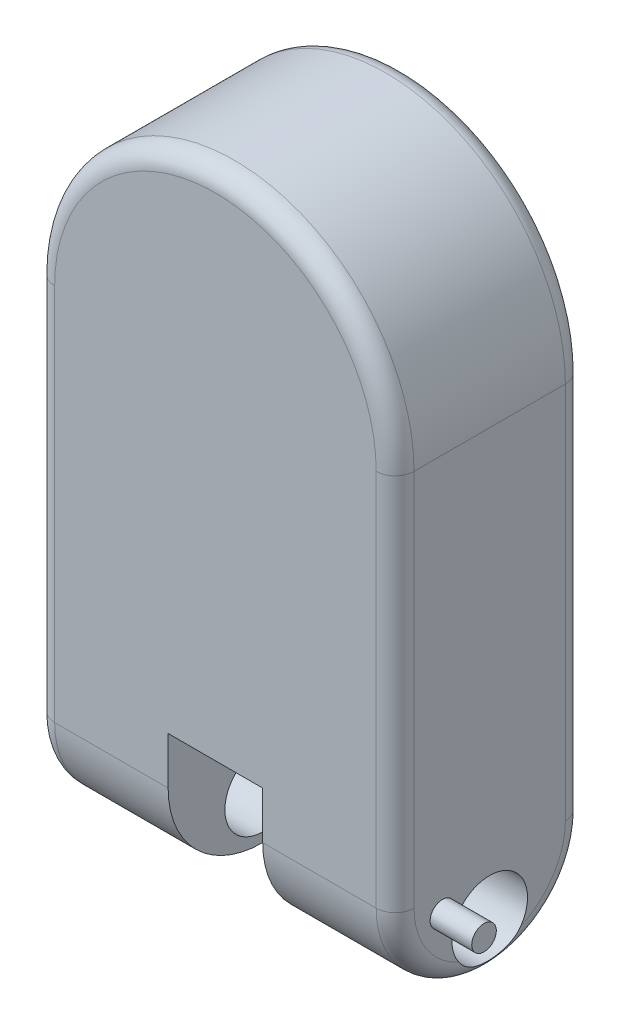
ISO-10303-21;
HEADER;
FILE_DESCRIPTION(('STEP AP214'),'2;1');
FILE_NAME('part.step','',(''),(''),'','','');
FILE_SCHEMA(('AUTOMOTIVE_DESIGN { 1 0 10303 214 1 1 1 1 }'));
ENDSEC;
DATA;
#1=APPLICATION_CONTEXT('core data for automotive mechanical design processes');
#2=APPLICATION_PROTOCOL_DEFINITION('international standard','automotive_design',2000,#1);
#3=PRODUCT_CONTEXT('',#1,'mechanical');
#4=PRODUCT('Part','Part','',(#3));
#5=PRODUCT_RELATED_PRODUCT_CATEGORY('part','',(#4));
#6=PRODUCT_DEFINITION_FORMATION('','',#4);
#7=PRODUCT_DEFINITION_CONTEXT('part definition',#1,'design');
#8=PRODUCT_DEFINITION('design','',#6,#7);
#9=PRODUCT_DEFINITION_SHAPE('','',#8);
#10=(LENGTH_UNIT() NAMED_UNIT(*) SI_UNIT(.MILLI.,.METRE.));
#11=(NAMED_UNIT(*) PLANE_ANGLE_UNIT() SI_UNIT($,.RADIAN.));
#12=(NAMED_UNIT(*) SI_UNIT($,.STERADIAN.) SOLID_ANGLE_UNIT());
#13=UNCERTAINTY_MEASURE_WITH_UNIT(LENGTH_MEASURE(1.E-05),#10,'distance_accuracy_value','');
#14=(GEOMETRIC_REPRESENTATION_CONTEXT(3) GLOBAL_UNCERTAINTY_ASSIGNED_CONTEXT((#13)) GLOBAL_UNIT_ASSIGNED_CONTEXT((#10,
#11,#12)) REPRESENTATION_CONTEXT('',''));
#15=CARTESIAN_POINT('',(0.,0.,0.));
#16=DIRECTION('',(0.,0.,1.));
#17=DIRECTION('',(1.,0.,0.));
#18=AXIS2_PLACEMENT_3D('',#15,#16,#17);
#19=CARTESIAN_POINT('',(-25.,-75.,-100.1));
#20=DIRECTION('',(0.,-1.,0.));
#21=DIRECTION('',(0.,0.,-1.));
#22=AXIS2_PLACEMENT_3D('',#19,#20,#21);
#23=PLANE('',#22);
#24=DIRECTION('',(1.,0.,0.));
#25=VECTOR('',#24,1.);
#26=CARTESIAN_POINT('',(-25.,-75.,-100.));
#27=LINE('',#26,#25);
#28=CARTESIAN_POINT('',(-25.,-75.,-100.));
#29=VERTEX_POINT('',#28);
#30=CARTESIAN_POINT('',(25.,-75.,-100.));
#31=VERTEX_POINT('',#30);
#32=EDGE_CURVE('E97',#29,#31,#27,.T.);
#33=ORIENTED_EDGE('',*,*,#32,.T.);
#34=CARTESIAN_POINT('',(23.5893264020334,-75.,-90.1));
#35=DIRECTION('',(0.,-1.,0.));
#36=DIRECTION('',(0.,0.,-1.));
#37=AXIS2_PLACEMENT_3D('',#34,#35,#36);
#38=CIRCLE('',#37,10.);
#39=CARTESIAN_POINT('',(23.5893264020334,-75.,-100.1));
#40=VERTEX_POINT('',#39);
#41=EDGE_CURVE('E12',#31,#40,#38,.F.);
#42=ORIENTED_EDGE('',*,*,#41,.T.);
#43=DIRECTION('',(1.,0.,0.));
#44=VECTOR('',#43,1.);
#45=CARTESIAN_POINT('',(-25.,-75.,-100.1));
#46=LINE('',#45,#44);
#47=CARTESIAN_POINT('',(-23.5893264020334,-75.,-100.1));
#48=VERTEX_POINT('',#47);
#49=EDGE_CURVE('E121',#48,#40,#46,.T.);
#50=ORIENTED_EDGE('',*,*,#49,.F.);
#51=CARTESIAN_POINT('',(-23.5893264020334,-75.,-90.1));
#52=DIRECTION('',(0.,-1.,0.));
#53=DIRECTION('',(0.,0.,-1.));
#54=AXIS2_PLACEMENT_3D('',#51,#52,#53);
#55=CIRCLE('',#54,10.);
#56=EDGE_CURVE('E60',#48,#29,#55,.F.);
#57=ORIENTED_EDGE('',*,*,#56,.T.);
#58=EDGE_LOOP('',(#33,#42,#50,#57));
#59=FACE_BOUND('',#58,.T.);
#60=ADVANCED_FACE('F51',(#59),#23,.F.);
#61=CARTESIAN_POINT('',(0.,0.,-100.1));
#62=DIRECTION('',(0.,0.,-1.));
#63=DIRECTION('',(-1.,0.,0.));
#64=AXIS2_PLACEMENT_3D('',#61,#62,#63);
#65=PLANE('',#64);
#66=ORIENTED_EDGE('',*,*,#49,.T.);
#67=DIRECTION('',(0.,1.,0.));
#68=VECTOR('',#67,1.);
#69=CARTESIAN_POINT('',(23.5893264020334,-105.,-100.1));
#70=LINE('',#69,#68);
#71=CARTESIAN_POINT('',(23.5893264020334,-103.589326402033,-100.1));
#72=VERTEX_POINT('',#71);
#73=EDGE_CURVE('E109',#40,#72,#70,.F.);
#74=ORIENTED_EDGE('',*,*,#73,.T.);
#75=DIRECTION('',(1.,0.,0.));
#76=VECTOR('',#75,1.);
#77=CARTESIAN_POINT('',(-25.,-103.589326402033,-100.1));
#78=LINE('',#77,#76);
#79=CARTESIAN_POINT('',(-23.5893264020334,-103.589326402033,-100.1));
#80=VERTEX_POINT('',#79);
#81=EDGE_CURVE('E75',#72,#80,#78,.F.);
#82=ORIENTED_EDGE('',*,*,#81,.T.);
#83=DIRECTION('',(0.,-1.,0.));
#84=VECTOR('',#83,1.);
#85=CARTESIAN_POINT('',(-23.5893264020334,-75.,-100.1));
#86=LINE('',#85,#84);
#87=EDGE_CURVE('E112',#80,#48,#86,.F.);
#88=ORIENTED_EDGE('',*,*,#87,.T.);
#89=EDGE_LOOP('',(#66,#74,#82,#88));
#90=FACE_BOUND('',#89,.T.);
#91=ADVANCED_FACE('F125',(#90),#65,.T.);
#92=CARTESIAN_POINT('',(0.,0.,-100.));
#93=DIRECTION('',(0.,0.,-1.));
#94=DIRECTION('',(-1.,0.,0.));
#95=AXIS2_PLACEMENT_3D('',#92,#93,#94);
#96=PLANE('',#95);
#97=ORIENTED_EDGE('',*,*,#32,.F.);
#98=DIRECTION('',(0.,1.,0.));
#99=VECTOR('',#98,1.);
#100=CARTESIAN_POINT('',(-25.,-105.,-100.));
#101=LINE('',#100,#99);
#102=CARTESIAN_POINT('',(-25.,-105.,-100.));
#103=VERTEX_POINT('',#102);
#104=EDGE_CURVE('E120',#103,#29,#101,.T.);
#105=ORIENTED_EDGE('',*,*,#104,.F.);
#106=DIRECTION('',(-1.,0.,0.));
#107=VECTOR('',#106,1.);
#108=CARTESIAN_POINT('',(25.,-105.,-100.));
#109=LINE('',#108,#107);
#110=CARTESIAN_POINT('',(25.,-105.,-100.));
#111=VERTEX_POINT('',#110);
#112=EDGE_CURVE('E100',#111,#103,#109,.T.);
#113=ORIENTED_EDGE('',*,*,#112,.F.);
#114=DIRECTION('',(0.,-1.,0.));
#115=VECTOR('',#114,1.);
#116=CARTESIAN_POINT('',(25.,-75.,-100.));
#117=LINE('',#116,#115);
#118=EDGE_CURVE('E94',#31,#111,#117,.T.);
#119=ORIENTED_EDGE('',*,*,#118,.F.);
#120=EDGE_LOOP('',(#97,#105,#113,#119));
#121=FACE_BOUND('',#120,.T.);
#122=ADVANCED_FACE('F96',(#121),#96,.F.);
#123=CARTESIAN_POINT('',(-23.5893264020334,-105.,-90.1));
#124=DIRECTION('',(0.,1.,0.));
#125=DIRECTION('',(0.,0.,1.));
#126=AXIS2_PLACEMENT_3D('',#123,#124,#125);
#127=CYLINDRICAL_SURFACE('',#126,10.);
#128=ORIENTED_EDGE('',*,*,#56,.F.);
#129=ORIENTED_EDGE('',*,*,#87,.F.);
#130=CARTESIAN_POINT('',(-23.5893264020334,-103.589326402033,-90.1));
#131=DIRECTION('',(-0.707106781186547,0.707106781186547,0.));
#132=DIRECTION('',(0.707106781186547,0.707106781186547,0.));
#133=AXIS2_PLACEMENT_3D('',#130,#131,#132);
#134=ELLIPSE('',#133,14.1421356237309,10.);
#135=EDGE_CURVE('E55',#103,#80,#134,.F.);
#136=ORIENTED_EDGE('',*,*,#135,.F.);
#137=ORIENTED_EDGE('',*,*,#104,.T.);
#138=EDGE_LOOP('',(#128,#129,#136,#137));
#139=FACE_BOUND('',#138,.T.);
#140=ADVANCED_FACE('F53',(#139),#127,.T.);
#141=CARTESIAN_POINT('',(25.,-103.589326402033,-90.1));
#142=DIRECTION('',(-1.,0.,0.));
#143=DIRECTION('',(0.,0.,1.));
#144=AXIS2_PLACEMENT_3D('',#141,#142,#143);
#145=CYLINDRICAL_SURFACE('',#144,10.);
#146=ORIENTED_EDGE('',*,*,#135,.T.);
#147=ORIENTED_EDGE('',*,*,#81,.F.);
#148=CARTESIAN_POINT('',(23.5893264020334,-103.589326402033,-90.1));
#149=DIRECTION('',(-0.707106781186547,-0.707106781186548,0.));
#150=DIRECTION('',(-0.707106781186548,0.707106781186547,0.));
#151=AXIS2_PLACEMENT_3D('',#148,#149,#150);
#152=ELLIPSE('',#151,14.142135623731,10.);
#153=EDGE_CURVE('E68',#111,#72,#152,.F.);
#154=ORIENTED_EDGE('',*,*,#153,.F.);
#155=ORIENTED_EDGE('',*,*,#112,.T.);
#156=EDGE_LOOP('',(#146,#147,#154,#155));
#157=FACE_BOUND('',#156,.T.);
#158=ADVANCED_FACE('F118',(#157),#145,.T.);
#159=CARTESIAN_POINT('',(23.5893264020334,-75.,-90.1));
#160=DIRECTION('',(0.,-1.,0.));
#161=DIRECTION('',(1.,0.,0.));
#162=AXIS2_PLACEMENT_3D('',#159,#160,#161);
#163=CYLINDRICAL_SURFACE('',#162,10.);
#164=ORIENTED_EDGE('',*,*,#41,.F.);
#165=ORIENTED_EDGE('',*,*,#118,.T.);
#166=ORIENTED_EDGE('',*,*,#153,.T.);
#167=ORIENTED_EDGE('',*,*,#73,.F.);
#168=EDGE_LOOP('',(#164,#165,#166,#167));
#169=FACE_BOUND('',#168,.T.);
#170=ADVANCED_FACE('F108',(#169),#163,.T.);
#171=CLOSED_SHELL('',(#60,#91,#122,#140,#158,#170));
#172=MANIFOLD_SOLID_BREP('B2',#171);
#173=CARTESIAN_POINT('',(0.,-75.,-50.));
#174=DIRECTION('',(1.,0.,0.));
#175=DIRECTION('',(0.,0.,-1.));
#176=AXIS2_PLACEMENT_3D('',#173,#174,#175);
#177=CYLINDRICAL_SURFACE('',#176,50.);
#178=DIRECTION('',(1.,0.,0.));
#179=VECTOR('',#178,1.);
#180=CARTESIAN_POINT('',(0.,-75.,0.));
#181=LINE('',#180,#179);
#182=CARTESIAN_POINT('',(-85.,-75.,0.));
#183=VERTEX_POINT('',#182);
#184=CARTESIAN_POINT('',(-25.,-75.,0.));
#185=VERTEX_POINT('',#184);
#186=EDGE_CURVE('E398',#183,#185,#181,.T.);
#187=ORIENTED_EDGE('',*,*,#186,.F.);
#188=CARTESIAN_POINT('',(-85.,-75.,-50.));
#189=DIRECTION('',(-1.,0.,0.));
#190=DIRECTION('',(0.,-1.,0.));
#191=AXIS2_PLACEMENT_3D('',#188,#189,#190);
#192=CIRCLE('',#191,50.);
#193=CARTESIAN_POINT('',(-85.,-125.,-50.));
#194=VERTEX_POINT('',#193);
#195=EDGE_CURVE('E198',#183,#194,#192,.F.);
#196=ORIENTED_EDGE('',*,*,#195,.T.);
#197=DIRECTION('',(1.,0.,0.));
#198=VECTOR('',#197,1.);
#199=CARTESIAN_POINT('',(-95.,-125.,-50.));
#200=LINE('',#199,#198);
#201=CARTESIAN_POINT('',(-25.,-125.,-50.));
#202=VERTEX_POINT('',#201);
#203=EDGE_CURVE('E354',#202,#194,#200,.F.);
#204=ORIENTED_EDGE('',*,*,#203,.F.);
#205=CARTESIAN_POINT('',(-25.,-75.,-50.));
#206=DIRECTION('',(-1.,0.,0.));
#207=DIRECTION('',(0.,0.,1.));
#208=AXIS2_PLACEMENT_3D('',#205,#206,#207);
#209=CIRCLE('',#208,50.);
#210=EDGE_CURVE('E373',#185,#202,#209,.F.);
#211=ORIENTED_EDGE('',*,*,#210,.F.);
#212=EDGE_LOOP('',(#187,#196,#204,#211));
#213=FACE_BOUND('',#212,.T.);
#214=ADVANCED_FACE('F175',(#213),#177,.T.);
#215=CARTESIAN_POINT('',(-95.,-75.,-50.));
#216=DIRECTION('',(-1.,0.,0.));
#217=DIRECTION('',(0.,0.,1.));
#218=AXIS2_PLACEMENT_3D('',#215,#216,#217);
#219=CYLINDRICAL_SURFACE('',#218,50.);
#220=ORIENTED_EDGE('',*,*,#203,.T.);
#221=CARTESIAN_POINT('',(-85.,-75.,-50.));
#222=DIRECTION('',(-1.,0.,0.));
#223=DIRECTION('',(0.,-1.,0.));
#224=AXIS2_PLACEMENT_3D('',#221,#222,#223);
#225=CIRCLE('',#224,50.);
#226=CARTESIAN_POINT('',(-85.,-75.,-100.));
#227=VERTEX_POINT('',#226);
#228=EDGE_CURVE('E184',#194,#227,#225,.F.);
#229=ORIENTED_EDGE('',*,*,#228,.T.);
#230=DIRECTION('',(1.,0.,0.));
#231=VECTOR('',#230,1.);
#232=CARTESIAN_POINT('',(-95.,-75.,-100.));
#233=LINE('',#232,#231);
#234=CARTESIAN_POINT('',(-25.,-75.,-100.));
#235=VERTEX_POINT('',#234);
#236=EDGE_CURVE('E393',#235,#227,#233,.F.);
#237=ORIENTED_EDGE('',*,*,#236,.F.);
#238=CARTESIAN_POINT('',(-25.,-75.,-50.));
#239=DIRECTION('',(-1.,0.,0.));
#240=DIRECTION('',(0.,0.,1.));
#241=AXIS2_PLACEMENT_3D('',#238,#239,#240);
#242=CIRCLE('',#241,50.);
#243=EDGE_CURVE('E382',#202,#235,#242,.F.);
#244=ORIENTED_EDGE('',*,*,#243,.F.);
#245=EDGE_LOOP('',(#220,#229,#237,#244));
#246=FACE_BOUND('',#245,.T.);
#247=ADVANCED_FACE('F511',(#246),#219,.T.);
#248=CARTESIAN_POINT('',(95.,125.,-100.));
#249=DIRECTION('',(1.,0.,0.));
#250=DIRECTION('',(0.,1.,0.));
#251=AXIS2_PLACEMENT_3D('',#248,#249,#250);
#252=PLANE('',#251);
#253=CARTESIAN_POINT('',(95.,-85.,-25.));
#254=DIRECTION('',(1.,0.,0.));
#255=DIRECTION('',(0.,1.,0.));
#256=AXIS2_PLACEMENT_3D('',#253,#254,#255);
#257=CIRCLE('',#256,6.50000000000002);
#258=CARTESIAN_POINT('',(95.,-78.5,-25.));
#259=VERTEX_POINT('',#258);
#260=EDGE_CURVE('E694',#259,#259,#257,.T.);
#261=ORIENTED_EDGE('',*,*,#260,.F.);
#262=EDGE_LOOP('',(#261));
#263=FACE_BOUND('',#262,.T.);
#264=CARTESIAN_POINT('',(95.,-75.,-50.));
#265=DIRECTION('',(1.,0.,0.));
#266=DIRECTION('',(0.,1.,0.));
#267=AXIS2_PLACEMENT_3D('',#264,#265,#266);
#268=CIRCLE('',#267,40.);
#269=CARTESIAN_POINT('',(95.0000000000001,-111.5,-66.3630681719536));
#270=VERTEX_POINT('',#269);
#271=CARTESIAN_POINT('',(95.,-75.,-90.));
#272=VERTEX_POINT('',#271);
#273=EDGE_CURVE('E430',#270,#272,#268,.T.);
#274=ORIENTED_EDGE('',*,*,#273,.T.);
#275=DIRECTION('',(0.,1.,0.));
#276=VECTOR('',#275,1.);
#277=CARTESIAN_POINT('',(95.,125.,-90.));
#278=LINE('',#277,#276);
#279=CARTESIAN_POINT('',(95.,125.,-90.));
#280=VERTEX_POINT('',#279);
#281=EDGE_CURVE('E433',#272,#280,#278,.T.);
#282=ORIENTED_EDGE('',*,*,#281,.T.);
#283=DIRECTION('',(0.,0.,1.));
#284=VECTOR('',#283,1.);
#285=CARTESIAN_POINT('',(95.,125.,-100.));
#286=LINE('',#285,#284);
#287=CARTESIAN_POINT('',(95.,125.,-9.99999999999999));
#288=VERTEX_POINT('',#287);
#289=EDGE_CURVE('E368',#280,#288,#286,.T.);
#290=ORIENTED_EDGE('',*,*,#289,.T.);
#291=DIRECTION('',(0.,1.,0.));
#292=VECTOR('',#291,1.);
#293=CARTESIAN_POINT('',(95.,125.,-9.99999999999999));
#294=LINE('',#293,#292);
#295=CARTESIAN_POINT('',(95.,-75.,-10.));
#296=VERTEX_POINT('',#295);
#297=EDGE_CURVE('E424',#288,#296,#294,.F.);
#298=ORIENTED_EDGE('',*,*,#297,.T.);
#299=CARTESIAN_POINT('',(95.,-75.,-50.));
#300=DIRECTION('',(1.,0.,0.));
#301=DIRECTION('',(0.,1.,0.));
#302=AXIS2_PLACEMENT_3D('',#299,#300,#301);
#303=CIRCLE('',#302,40.);
#304=CARTESIAN_POINT('',(95.,-111.5,-33.6369318280464));
#305=VERTEX_POINT('',#304);
#306=EDGE_CURVE('E427',#296,#305,#303,.T.);
#307=ORIENTED_EDGE('',*,*,#306,.T.);
#308=CARTESIAN_POINT('',(95.,-100.,-50.));
#309=DIRECTION('',(-1.,0.,0.));
#310=DIRECTION('',(0.,-1.,0.));
#311=AXIS2_PLACEMENT_3D('',#308,#309,#310);
#312=CIRCLE('',#311,20.);
#313=EDGE_CURVE('E355',#305,#270,#312,.T.);
#314=ORIENTED_EDGE('',*,*,#313,.T.);
#315=EDGE_LOOP('',(#274,#282,#290,#298,#307,#314));
#316=FACE_BOUND('',#315,.T.);
#317=ADVANCED_FACE('F516',(#263,#316),#252,.T.);
#318=CARTESIAN_POINT('',(-95.,125.,-100.));
#319=DIRECTION('',(-1.,0.,0.));
#320=DIRECTION('',(0.,-1.,0.));
#321=AXIS2_PLACEMENT_3D('',#318,#319,#320);
#322=PLANE('',#321);
#323=CARTESIAN_POINT('',(-95.,-75.,-50.));
#324=DIRECTION('',(-1.,0.,0.));
#325=DIRECTION('',(0.,-1.,0.));
#326=AXIS2_PLACEMENT_3D('',#323,#324,#325);
#327=CIRCLE('',#326,40.);
#328=CARTESIAN_POINT('',(-95.,-111.5,-33.6369318280464));
#329=VERTEX_POINT('',#328);
#330=CARTESIAN_POINT('',(-95.,-75.,-10.));
#331=VERTEX_POINT('',#330);
#332=EDGE_CURVE('E596',#329,#331,#327,.T.);
#333=ORIENTED_EDGE('',*,*,#332,.T.);
#334=DIRECTION('',(0.,-1.,0.));
#335=VECTOR('',#334,1.);
#336=CARTESIAN_POINT('',(-95.,125.,-9.99999999999999));
#337=LINE('',#336,#335);
#338=CARTESIAN_POINT('',(-95.,125.,-9.99999999999999));
#339=VERTEX_POINT('',#338);
#340=EDGE_CURVE('E482',#331,#339,#337,.F.);
#341=ORIENTED_EDGE('',*,*,#340,.T.);
#342=DIRECTION('',(0.,0.,1.));
#343=VECTOR('',#342,1.);
#344=CARTESIAN_POINT('',(-95.,125.,-100.));
#345=LINE('',#344,#343);
#346=CARTESIAN_POINT('',(-95.,125.,-90.));
#347=VERTEX_POINT('',#346);
#348=EDGE_CURVE('E369',#347,#339,#345,.T.);
#349=ORIENTED_EDGE('',*,*,#348,.F.);
#350=DIRECTION('',(0.,-1.,0.));
#351=VECTOR('',#350,1.);
#352=CARTESIAN_POINT('',(-95.,-75.,-90.));
#353=LINE('',#352,#351);
#354=CARTESIAN_POINT('',(-95.,-75.,-90.));
#355=VERTEX_POINT('',#354);
#356=EDGE_CURVE('E588',#347,#355,#353,.T.);
#357=ORIENTED_EDGE('',*,*,#356,.T.);
#358=CARTESIAN_POINT('',(-95.,-75.,-50.));
#359=DIRECTION('',(-1.,0.,0.));
#360=DIRECTION('',(0.,-1.,0.));
#361=AXIS2_PLACEMENT_3D('',#358,#359,#360);
#362=CIRCLE('',#361,40.);
#363=CARTESIAN_POINT('',(-95.,-111.5,-66.3630681719536));
#364=VERTEX_POINT('',#363);
#365=EDGE_CURVE('E594',#355,#364,#362,.T.);
#366=ORIENTED_EDGE('',*,*,#365,.T.);
#367=CARTESIAN_POINT('',(-95.,-100.,-50.));
#368=DIRECTION('',(-1.,0.,0.));
#369=DIRECTION('',(0.,-1.,0.));
#370=AXIS2_PLACEMENT_3D('',#367,#368,#369);
#371=CIRCLE('',#370,20.);
#372=EDGE_CURVE('E360',#329,#364,#371,.T.);
#373=ORIENTED_EDGE('',*,*,#372,.F.);
#374=EDGE_LOOP('',(#333,#341,#349,#357,#366,#373));
#375=FACE_BOUND('',#374,.T.);
#376=ADVANCED_FACE('F603',(#375),#322,.T.);
#377=CARTESIAN_POINT('',(0.,0.,-100.));
#378=DIRECTION('',(0.,0.,1.));
#379=DIRECTION('',(1.,0.,0.));
#380=AXIS2_PLACEMENT_3D('',#377,#378,#379);
#381=PLANE('',#380);
#382=CARTESIAN_POINT('',(0.,125.,-100.));
#383=DIRECTION('',(0.,0.,1.));
#384=DIRECTION('',(1.,0.,0.));
#385=AXIS2_PLACEMENT_3D('',#382,#383,#384);
#386=CIRCLE('',#385,85.);
#387=CARTESIAN_POINT('',(-85.,125.,-100.));
#388=VERTEX_POINT('',#387);
#389=CARTESIAN_POINT('',(85.,125.,-100.));
#390=VERTEX_POINT('',#389);
#391=EDGE_CURVE('E417',#388,#390,#386,.F.);
#392=ORIENTED_EDGE('',*,*,#391,.T.);
#393=DIRECTION('',(0.,1.,0.));
#394=VECTOR('',#393,1.);
#395=CARTESIAN_POINT('',(85.,-75.,-100.));
#396=LINE('',#395,#394);
#397=CARTESIAN_POINT('',(85.,-75.,-100.));
#398=VERTEX_POINT('',#397);
#399=EDGE_CURVE('E421',#390,#398,#396,.F.);
#400=ORIENTED_EDGE('',*,*,#399,.T.);
#401=CARTESIAN_POINT('',(25.,-75.,-100.));
#402=VERTEX_POINT('',#401);
#403=EDGE_CURVE('E399',#398,#402,#233,.F.);
#404=ORIENTED_EDGE('',*,*,#403,.T.);
#405=DIRECTION('',(-1.,0.,0.));
#406=VECTOR('',#405,1.);
#407=CARTESIAN_POINT('',(-25.,-75.,-100.));
#408=LINE('',#407,#406);
#409=EDGE_CURVE('E346',#402,#235,#408,.T.);
#410=ORIENTED_EDGE('',*,*,#409,.T.);
#411=ORIENTED_EDGE('',*,*,#236,.T.);
#412=DIRECTION('',(0.,-1.,0.));
#413=VECTOR('',#412,1.);
#414=CARTESIAN_POINT('',(-85.,125.,-100.));
#415=LINE('',#414,#413);
#416=EDGE_CURVE('E414',#227,#388,#415,.F.);
#417=ORIENTED_EDGE('',*,*,#416,.T.);
#418=EDGE_LOOP('',(#392,#400,#404,#410,#411,#417));
#419=FACE_BOUND('',#418,.T.);
#420=ADVANCED_FACE('F651',(#419),#381,.F.);
#421=CARTESIAN_POINT('',(0.,0.,0.));
#422=DIRECTION('',(0.,0.,1.));
#423=DIRECTION('',(1.,0.,0.));
#424=AXIS2_PLACEMENT_3D('',#421,#422,#423);
#425=PLANE('',#424);
#426=DIRECTION('',(0.,-1.,0.));
#427=VECTOR('',#426,1.);
#428=CARTESIAN_POINT('',(-25.,-75.,0.));
#429=LINE('',#428,#427);
#430=CARTESIAN_POINT('',(-25.,-50.,0.));
#431=VERTEX_POINT('',#430);
#432=EDGE_CURVE('E322',#431,#185,#429,.T.);
#433=ORIENTED_EDGE('',*,*,#432,.F.);
#434=DIRECTION('',(-1.,0.,0.));
#435=VECTOR('',#434,1.);
#436=CARTESIAN_POINT('',(-25.,-50.,0.));
#437=LINE('',#436,#435);
#438=CARTESIAN_POINT('',(25.,-50.,0.));
#439=VERTEX_POINT('',#438);
#440=EDGE_CURVE('E333',#439,#431,#437,.T.);
#441=ORIENTED_EDGE('',*,*,#440,.F.);
#442=DIRECTION('',(0.,1.,0.));
#443=VECTOR('',#442,1.);
#444=CARTESIAN_POINT('',(25.,-50.,0.));
#445=LINE('',#444,#443);
#446=CARTESIAN_POINT('',(25.,-75.,0.));
#447=VERTEX_POINT('',#446);
#448=EDGE_CURVE('E311',#447,#439,#445,.T.);
#449=ORIENTED_EDGE('',*,*,#448,.F.);
#450=CARTESIAN_POINT('',(85.,-75.,0.));
#451=VERTEX_POINT('',#450);
#452=EDGE_CURVE('E402',#447,#451,#181,.T.);
#453=ORIENTED_EDGE('',*,*,#452,.T.);
#454=DIRECTION('',(0.,1.,0.));
#455=VECTOR('',#454,1.);
#456=CARTESIAN_POINT('',(85.,0.,0.));
#457=LINE('',#456,#455);
#458=CARTESIAN_POINT('',(85.,125.,0.));
#459=VERTEX_POINT('',#458);
#460=EDGE_CURVE('E576',#451,#459,#457,.T.);
#461=ORIENTED_EDGE('',*,*,#460,.T.);
#462=CARTESIAN_POINT('',(0.,125.,0.));
#463=DIRECTION('',(0.,0.,1.));
#464=DIRECTION('',(1.,0.,0.));
#465=AXIS2_PLACEMENT_3D('',#462,#463,#464);
#466=CIRCLE('',#465,85.);
#467=CARTESIAN_POINT('',(-85.,125.,0.));
#468=VERTEX_POINT('',#467);
#469=EDGE_CURVE('E581',#459,#468,#466,.T.);
#470=ORIENTED_EDGE('',*,*,#469,.T.);
#471=DIRECTION('',(0.,-1.,0.));
#472=VECTOR('',#471,1.);
#473=CARTESIAN_POINT('',(-85.,0.,0.));
#474=LINE('',#473,#472);
#475=EDGE_CURVE('E544',#468,#183,#474,.T.);
#476=ORIENTED_EDGE('',*,*,#475,.T.);
#477=ORIENTED_EDGE('',*,*,#186,.T.);
#478=EDGE_LOOP('',(#433,#441,#449,#453,#461,#470,#476,#477));
#479=FACE_BOUND('',#478,.T.);
#480=ADVANCED_FACE('F663',(#479),#425,.T.);
#481=CARTESIAN_POINT('',(25.,-150.,-100.));
#482=DIRECTION('',(1.,0.,0.));
#483=DIRECTION('',(0.,0.,-1.));
#484=AXIS2_PLACEMENT_3D('',#481,#482,#483);
#485=PLANE('',#484);
#486=CARTESIAN_POINT('',(25.,-75.,-50.));
#487=DIRECTION('',(1.,0.,0.));
#488=DIRECTION('',(0.,0.,-1.));
#489=AXIS2_PLACEMENT_3D('',#486,#487,#488);
#490=CIRCLE('',#489,50.);
#491=CARTESIAN_POINT('',(25.,-125.,-50.));
#492=VERTEX_POINT('',#491);
#493=EDGE_CURVE('E386',#492,#447,#490,.F.);
#494=ORIENTED_EDGE('',*,*,#493,.T.);
#495=ORIENTED_EDGE('',*,*,#448,.T.);
#496=DIRECTION('',(0.,0.,1.));
#497=VECTOR('',#496,1.);
#498=CARTESIAN_POINT('',(25.,-50.,-99.));
#499=LINE('',#498,#497);
#500=CARTESIAN_POINT('',(25.,-50.,-99.));
#501=VERTEX_POINT('',#500);
#502=EDGE_CURVE('E303',#501,#439,#499,.T.);
#503=ORIENTED_EDGE('',*,*,#502,.F.);
#504=DIRECTION('',(0.,1.,0.));
#505=VECTOR('',#504,1.);
#506=CARTESIAN_POINT('',(25.,-50.,-99.));
#507=LINE('',#506,#505);
#508=CARTESIAN_POINT('',(25.,-74.4302970896538,-99.));
#509=VERTEX_POINT('',#508);
#510=EDGE_CURVE('E309',#509,#501,#507,.T.);
#511=ORIENTED_EDGE('',*,*,#510,.F.);
#512=CARTESIAN_POINT('',(25.,-161.602540378444,-50.));
#513=DIRECTION('',(1.,0.,0.));
#514=DIRECTION('',(0.,0.,-1.));
#515=AXIS2_PLACEMENT_3D('',#512,#513,#514);
#516=CIRCLE('',#515,100.);
#517=EDGE_CURVE('E347',#402,#509,#516,.T.);
#518=ORIENTED_EDGE('',*,*,#517,.F.);
#519=CARTESIAN_POINT('',(25.,-75.,-50.));
#520=DIRECTION('',(1.,0.,0.));
#521=DIRECTION('',(0.,0.,-1.));
#522=AXIS2_PLACEMENT_3D('',#519,#520,#521);
#523=CIRCLE('',#522,50.);
#524=EDGE_CURVE('E389',#402,#492,#523,.F.);
#525=ORIENTED_EDGE('',*,*,#524,.T.);
#526=EDGE_LOOP('',(#494,#495,#503,#511,#518,#525));
#527=FACE_BOUND('',#526,.T.);
#528=CARTESIAN_POINT('',(25.,-100.,-50.));
#529=DIRECTION('',(1.,0.,0.));
#530=DIRECTION('',(0.,0.,-1.));
#531=AXIS2_PLACEMENT_3D('',#528,#529,#530);
#532=CIRCLE('',#531,20.);
#533=CARTESIAN_POINT('',(25.,-100.,-70.));
#534=VERTEX_POINT('',#533);
#535=EDGE_CURVE('E364',#534,#534,#532,.T.);
#536=ORIENTED_EDGE('',*,*,#535,.T.);
#537=EDGE_LOOP('',(#536));
#538=FACE_BOUND('',#537,.T.);
#539=ADVANCED_FACE('F306',(#527,#538),#485,.F.);
#540=CARTESIAN_POINT('',(-25.,-150.,-100.));
#541=DIRECTION('',(-1.,0.,0.));
#542=DIRECTION('',(0.,0.,1.));
#543=AXIS2_PLACEMENT_3D('',#540,#541,#542);
#544=PLANE('',#543);
#545=ORIENTED_EDGE('',*,*,#432,.T.);
#546=ORIENTED_EDGE('',*,*,#210,.T.);
#547=ORIENTED_EDGE('',*,*,#243,.T.);
#548=CARTESIAN_POINT('',(-25.,-161.602540378444,-50.));
#549=DIRECTION('',(1.,0.,0.));
#550=DIRECTION('',(0.,0.,-1.));
#551=AXIS2_PLACEMENT_3D('',#548,#549,#550);
#552=CIRCLE('',#551,100.);
#553=CARTESIAN_POINT('',(-25.,-74.4302970896538,-99.));
#554=VERTEX_POINT('',#553);
#555=EDGE_CURVE('E342',#235,#554,#552,.T.);
#556=ORIENTED_EDGE('',*,*,#555,.T.);
#557=DIRECTION('',(0.,-1.,0.));
#558=VECTOR('',#557,1.);
#559=CARTESIAN_POINT('',(-25.,-75.,-99.));
#560=LINE('',#559,#558);
#561=CARTESIAN_POINT('',(-25.,-50.,-99.));
#562=VERTEX_POINT('',#561);
#563=EDGE_CURVE('E191',#562,#554,#560,.T.);
#564=ORIENTED_EDGE('',*,*,#563,.F.);
#565=DIRECTION('',(0.,0.,1.));
#566=VECTOR('',#565,1.);
#567=CARTESIAN_POINT('',(-25.,-50.,-99.));
#568=LINE('',#567,#566);
#569=EDGE_CURVE('E317',#562,#431,#568,.T.);
#570=ORIENTED_EDGE('',*,*,#569,.T.);
#571=EDGE_LOOP('',(#545,#546,#547,#556,#564,#570));
#572=FACE_BOUND('',#571,.T.);
#573=CARTESIAN_POINT('',(-25.,-100.,-50.));
#574=DIRECTION('',(-1.,0.,0.));
#575=DIRECTION('',(0.,0.,1.));
#576=AXIS2_PLACEMENT_3D('',#573,#574,#575);
#577=CIRCLE('',#576,20.);
#578=CARTESIAN_POINT('',(-25.,-100.,-30.));
#579=VERTEX_POINT('',#578);
#580=EDGE_CURVE('E359',#579,#579,#577,.T.);
#581=ORIENTED_EDGE('',*,*,#580,.T.);
#582=EDGE_LOOP('',(#581));
#583=FACE_BOUND('',#582,.T.);
#584=ADVANCED_FACE('F466',(#572,#583),#544,.F.);
#585=CARTESIAN_POINT('',(95.,-100.,-50.));
#586=DIRECTION('',(-1.,0.,0.));
#587=DIRECTION('',(0.,-1.,0.));
#588=AXIS2_PLACEMENT_3D('',#585,#586,#587);
#589=CYLINDRICAL_SURFACE('',#588,20.);
#590=CARTESIAN_POINT('',(-95.,-111.5,-66.3630681719536));
#591=CARTESIAN_POINT('',(-94.9999944988369,-111.717635786294,-66.2101150233157));
#592=CARTESIAN_POINT('',(-94.9972251505422,-111.932182024762,-66.0528421805291));
#593=CARTESIAN_POINT('',(-94.9867556613727,-112.35473388776,-65.7299474304971));
#594=CARTESIAN_POINT('',(-94.9790561221654,-112.562740307143,-65.5643265442968));
#595=CARTESIAN_POINT('',(-94.9494718778201,-113.176161814739,-65.0555886797702));
#596=CARTESIAN_POINT('',(-94.9210996400918,-113.571325329765,-64.7003530754296));
#597=CARTESIAN_POINT('',(-94.8515096756831,-114.330811895632,-63.9609577577295));
#598=CARTESIAN_POINT('',(-94.8103152955771,-114.695189480587,-63.5768515684689));
#599=CARTESIAN_POINT('',(-94.7190573029856,-115.391950208584,-62.7815251896323));
#600=CARTESIAN_POINT('',(-94.6689923089183,-115.724328355308,-62.3703007827167));
#601=CARTESIAN_POINT('',(-94.5631593930954,-116.358618976357,-61.5187034560061));
#602=CARTESIAN_POINT('',(-94.5073357106278,-116.660163582177,-61.0780636594513));
#603=CARTESIAN_POINT('',(-94.3940622995594,-117.226993438192,-60.1742441935076));
#604=CARTESIAN_POINT('',(-94.3366125479803,-117.492278175682,-59.7110642055318));
#605=CARTESIAN_POINT('',(-94.223501755816,-117.985054029716,-58.7648363026766));
#606=CARTESIAN_POINT('',(-94.167840615512,-118.212547256171,-58.2817894988468));
#607=CARTESIAN_POINT('',(-94.0614849028067,-118.628363325728,-57.2985605452277));
#608=CARTESIAN_POINT('',(-94.0107905215469,-118.816684661646,-56.7983777369727));
#609=CARTESIAN_POINT('',(-93.914628020795,-119.162335252227,-55.7553050669512));
#610=CARTESIAN_POINT('',(-93.8696146444547,-119.31732359583,-55.2115959974652));
#611=CARTESIAN_POINT('',(-93.7912772213223,-119.580856141992,-54.1121164115952));
#612=CARTESIAN_POINT('',(-93.7579530630838,-119.689400787352,-53.5563460102591));
#613=CARTESIAN_POINT('',(-93.7183397843355,-119.816752364834,-52.7160701639446));
#614=CARTESIAN_POINT('',(-93.7068534918599,-119.853323941299,-52.4343883277259));
#615=CARTESIAN_POINT('',(-93.6875556329067,-119.914450380322,-51.869577925022));
#616=CARTESIAN_POINT('',(-93.6797440577708,-119.939005271195,-51.586449361947));
#617=CARTESIAN_POINT('',(-93.6679366207012,-119.976034163262,-51.0192418997108));
#618=CARTESIAN_POINT('',(-93.6639419207102,-119.988504485659,-50.7351627375596));
#619=CARTESIAN_POINT('',(-93.6598264732936,-120.001327339773,-50.1666967726028));
#620=CARTESIAN_POINT('',(-93.6597058137055,-120.001679596733,-49.882309962968));
#621=CARTESIAN_POINT('',(-93.6615493262836,-119.995960582491,-49.5980542531014));
#622=B_SPLINE_CURVE_WITH_KNOTS('',3,(#590,#591,#592,#593,#594,#595,#596,#597,#598,#599,#600,
#601,#602,#603,#604,#605,#606,#607,#608,#609,#610,#611,#612,#613,#614,#615,#616,#617,#618,#619,
#620,#621),.UNSPECIFIED.,.F.,.F.,(4,2,2,2,2,2,2,2,2,2,2,2,2,2,2,4),(0.,0.797874642750549,
1.59565193352406,3.1899412608992,4.78134451960054,6.37299585463969,7.98184001143661,
9.59070691451071,11.1994839638915,12.8083229014095,14.5077128583875,16.2070866127463,
17.0596892460926,17.91228987052,18.7651499631725,19.6180293930039),.UNSPECIFIED.);
#623=CARTESIAN_POINT('',(-93.6602540378444,-120.,-50.));
#624=VERTEX_POINT('',#623);
#625=EDGE_CURVE('E473',#364,#624,#622,.T.);
#626=ORIENTED_EDGE('',*,*,#625,.T.);
#627=CARTESIAN_POINT('',(-93.6602540378444,-120.,-50.));
#628=CARTESIAN_POINT('',(-93.660247528865,-120.000000557423,-49.7291162562174));
#629=CARTESIAN_POINT('',(-93.6620203059655,-119.994495715576,-49.4582663052626));
#630=CARTESIAN_POINT('',(-93.6690632302412,-119.972496289671,-48.9170644816353));
#631=CARTESIAN_POINT('',(-93.6743333002116,-119.956001948214,-48.6467125980998));
#632=CARTESIAN_POINT('',(-93.6952902819852,-119.8900894424,-47.8373209986366));
#633=CARTESIAN_POINT('',(-93.7161240917141,-119.824241746037,-47.2996541799823));
#634=CARTESIAN_POINT('',(-93.7701739357349,-119.649543192614,-46.2334838396406));
#635=CARTESIAN_POINT('',(-93.8033583037589,-119.540802269524,-45.7049604702912));
#636=CARTESIAN_POINT('',(-93.8801161670473,-119.281208901752,-44.6590938773701));
#637=CARTESIAN_POINT('',(-93.9236903013259,-119.130353866779,-44.1417513436021));
#638=CARTESIAN_POINT('',(-94.0189152913429,-118.786789461718,-43.1189296044383));
#639=CARTESIAN_POINT('',(-94.0706068716683,-118.593867036125,-42.6135258599768));
#640=CARTESIAN_POINT('',(-94.1788835403941,-118.16796707267,-41.6204488654864));
#641=CARTESIAN_POINT('',(-94.2354685830894,-117.934989908899,-41.1327754499163));
#642=CARTESIAN_POINT('',(-94.3502215235499,-117.430402873405,-40.1779497284365));
#643=CARTESIAN_POINT('',(-94.4083896442132,-117.158787538414,-39.7108003367798));
#644=CARTESIAN_POINT('',(-94.5227473765823,-116.578517537487,-38.7998012021265));
#645=CARTESIAN_POINT('',(-94.5789368427548,-116.269860154377,-38.3559531718098));
#646=CARTESIAN_POINT('',(-94.6878982994192,-115.602912464245,-37.4753289636808));
#647=CARTESIAN_POINT('',(-94.740412180585,-115.243038677624,-37.0397174887075));
#648=CARTESIAN_POINT('',(-94.8345685865417,-114.487138492257,-36.1999281519389));
#649=CARTESIAN_POINT('',(-94.8762127470129,-114.09111754507,-35.7957455671454));
#650=CARTESIAN_POINT('',(-94.9437724111679,-113.26432007541,-35.0206968408248));
#651=CARTESIAN_POINT('',(-94.969646571122,-112.833455521703,-34.6499204268788));
#652=CARTESIAN_POINT('',(-94.992406932906,-112.164262783443,-34.1219764911395));
#653=CARTESIAN_POINT('',(-94.997317042392,-111.937265917523,-33.9506217314705));
#654=CARTESIAN_POINT('',(-95.001019493978,-111.47611190923,-33.6177002554482));
#655=CARTESIAN_POINT('',(-94.9998109947272,-111.241953786537,-33.4561348882949));
#656=CARTESIAN_POINT('',(-94.9951651075579,-111.004453188326,-33.299640422256));
#657=B_SPLINE_CURVE_WITH_KNOTS('',3,(#627,#628,#629,#630,#631,#632,#633,#634,#635,#636,#637,
#638,#639,#640,#641,#642,#643,#644,#645,#646,#647,#648,#649,#650,#651,#652,#653,#654,#655,#656),
.UNSPECIFIED.,.F.,.F.,(4,2,2,2,2,2,2,2,2,2,2,2,2,2,4),(0.,0.812522437824897,1.62502693931456,
3.24916534614429,4.86916790626039,6.48927012904759,8.1177764581638,9.74626757863838,
11.3749891898565,13.0038303470725,14.704137296452,16.404188235224,18.1086771866605,
18.9617565600298,19.8149532408673),.UNSPECIFIED.);
#658=EDGE_CURVE('E481',#624,#329,#657,.T.);
#659=ORIENTED_EDGE('',*,*,#658,.T.);
#660=ORIENTED_EDGE('',*,*,#372,.T.);
#661=EDGE_LOOP('',(#626,#659,#660));
#662=FACE_BOUND('',#661,.T.);
#663=ORIENTED_EDGE('',*,*,#580,.F.);
#664=EDGE_LOOP('',(#663));
#665=FACE_BOUND('',#664,.T.);
#666=ADVANCED_FACE('F462',(#662,#665),#589,.F.);
#667=CARTESIAN_POINT('',(95.,-111.5,-33.6369318280464));
#668=CARTESIAN_POINT('',(94.9999944988369,-111.717635786294,-33.7898849766843));
#669=CARTESIAN_POINT('',(94.9972251505423,-111.932182024762,-33.9471578194709));
#670=CARTESIAN_POINT('',(94.9867556613727,-112.35473388776,-34.270052569503));
#671=CARTESIAN_POINT('',(94.9790561221654,-112.562740307143,-34.4356734557032));
#672=CARTESIAN_POINT('',(94.9494718778202,-113.176161814739,-34.9444113202299));
#673=CARTESIAN_POINT('',(94.9210996400919,-113.571325329765,-35.2996469245705));
#674=CARTESIAN_POINT('',(94.8515096756831,-114.330811895632,-36.0390422422705));
#675=CARTESIAN_POINT('',(94.8103152955772,-114.695189480587,-36.4231484315311));
#676=CARTESIAN_POINT('',(94.7190573029856,-115.391950208584,-37.2184748103677));
#677=CARTESIAN_POINT('',(94.6689923089184,-115.724328355308,-37.6296992172834));
#678=CARTESIAN_POINT('',(94.5631593930954,-116.358618976357,-38.481296543994));
#679=CARTESIAN_POINT('',(94.5073357106278,-116.660163582177,-38.9219363405488));
#680=CARTESIAN_POINT('',(94.3940622995595,-117.226993438192,-39.8257558064925));
#681=CARTESIAN_POINT('',(94.3366125479804,-117.492278175682,-40.2889357944682));
#682=CARTESIAN_POINT('',(94.223501755816,-117.985054029716,-41.2351636973234));
#683=CARTESIAN_POINT('',(94.1678406155121,-118.212547256171,-41.7182105011533));
#684=CARTESIAN_POINT('',(94.0614849028068,-118.628363325728,-42.7014394547724));
#685=CARTESIAN_POINT('',(94.0107905215469,-118.816684661646,-43.2016222630274));
#686=CARTESIAN_POINT('',(93.914628020795,-119.162335252227,-44.2446949330489));
#687=CARTESIAN_POINT('',(93.8696146444547,-119.31732359583,-44.7884040025349));
#688=CARTESIAN_POINT('',(93.7912772213223,-119.580856141992,-45.8878835884048));
#689=CARTESIAN_POINT('',(93.7579530630839,-119.689400787352,-46.443653989741));
#690=CARTESIAN_POINT('',(93.7183397843356,-119.816752364834,-47.2839298360555));
#691=CARTESIAN_POINT('',(93.7068534918599,-119.853323941299,-47.5656116722741));
#692=CARTESIAN_POINT('',(93.6875556329068,-119.914450380322,-48.1304220749781));
#693=CARTESIAN_POINT('',(93.6797440577709,-119.939005271195,-48.4135506380531));
#694=CARTESIAN_POINT('',(93.6679366207012,-119.976034163262,-48.9807581002893));
#695=CARTESIAN_POINT('',(93.6639419207103,-119.988504485659,-49.2648372624404));
#696=CARTESIAN_POINT('',(93.6598264732937,-120.001327339773,-49.8333032273972));
#697=CARTESIAN_POINT('',(93.6597058137055,-120.001679596733,-50.1176900370321));
#698=CARTESIAN_POINT('',(93.6615493262836,-119.995960582491,-50.4019457468987));
#699=B_SPLINE_CURVE_WITH_KNOTS('',3,(#667,#668,#669,#670,#671,#672,#673,#674,#675,#676,#677,
#678,#679,#680,#681,#682,#683,#684,#685,#686,#687,#688,#689,#690,#691,#692,#693,#694,#695,#696,
#697,#698),.UNSPECIFIED.,.F.,.F.,(4,2,2,2,2,2,2,2,2,2,2,2,2,2,2,4),(0.,0.797874642750553,
1.59565193352408,3.18994126089918,4.7813445196005,6.3729958546397,7.98184001143661,
9.59070691451071,11.1994839638915,12.8083229014096,14.5077128583875,16.2070866127463,
17.0596892460926,17.91228987052,18.7651499631725,19.6180293930039),.UNSPECIFIED.);
#700=CARTESIAN_POINT('',(93.6602540378444,-120.,-50.));
#701=VERTEX_POINT('',#700);
#702=EDGE_CURVE('E436',#305,#701,#699,.T.);
#703=ORIENTED_EDGE('',*,*,#702,.T.);
#704=CARTESIAN_POINT('',(93.6602540378444,-120.,-50.));
#705=CARTESIAN_POINT('',(93.6602475288651,-120.000000557423,-50.2708837437826));
#706=CARTESIAN_POINT('',(93.6620203059656,-119.994495715576,-50.5417336947374));
#707=CARTESIAN_POINT('',(93.6690632302413,-119.972496289671,-51.0829355183647));
#708=CARTESIAN_POINT('',(93.6743333002116,-119.956001948214,-51.3532874019002));
#709=CARTESIAN_POINT('',(93.6952902819852,-119.8900894424,-52.1626790013634));
#710=CARTESIAN_POINT('',(93.7161240917141,-119.824241746037,-52.7003458200177));
#711=CARTESIAN_POINT('',(93.7701739357349,-119.649543192614,-53.7665161603594));
#712=CARTESIAN_POINT('',(93.8033583037589,-119.540802269524,-54.2950395297088));
#713=CARTESIAN_POINT('',(93.8801161670473,-119.281208901752,-55.3409061226299));
#714=CARTESIAN_POINT('',(93.923690301326,-119.130353866779,-55.8582486563979));
#715=CARTESIAN_POINT('',(94.0189152913429,-118.786789461718,-56.8810703955617));
#716=CARTESIAN_POINT('',(94.0706068716684,-118.593867036125,-57.3864741400232));
#717=CARTESIAN_POINT('',(94.1788835403941,-118.16796707267,-58.3795511345136));
#718=CARTESIAN_POINT('',(94.2354685830894,-117.934989908899,-58.8672245500837));
#719=CARTESIAN_POINT('',(94.35022152355,-117.430402873405,-59.8220502715635));
#720=CARTESIAN_POINT('',(94.4083896442133,-117.158787538414,-60.2891996632202));
#721=CARTESIAN_POINT('',(94.5227473765824,-116.578517537487,-61.2001987978735));
#722=CARTESIAN_POINT('',(94.5789368427548,-116.269860154377,-61.6440468281903));
#723=CARTESIAN_POINT('',(94.6878982994192,-115.602912464245,-62.5246710363192));
#724=CARTESIAN_POINT('',(94.740412180585,-115.243038677624,-62.9602825112926));
#725=CARTESIAN_POINT('',(94.8345685865418,-114.487138492257,-63.8000718480611));
#726=CARTESIAN_POINT('',(94.8762127470129,-114.09111754507,-64.2042544328546));
#727=CARTESIAN_POINT('',(94.943772411168,-113.26432007541,-64.9793031591752));
#728=CARTESIAN_POINT('',(94.969646571122,-112.833455521703,-65.3500795731212));
#729=CARTESIAN_POINT('',(94.992406932906,-112.164262783443,-65.8780235088606));
#730=CARTESIAN_POINT('',(94.9973170423921,-111.937265917523,-66.0493782685295));
#731=CARTESIAN_POINT('',(95.0010194939781,-111.47611190923,-66.3822997445518));
#732=CARTESIAN_POINT('',(94.9998109947272,-111.241953786537,-66.5438651117052));
#733=CARTESIAN_POINT('',(94.995165107558,-111.004453188326,-66.700359577744));
#734=B_SPLINE_CURVE_WITH_KNOTS('',3,(#704,#705,#706,#707,#708,#709,#710,#711,#712,#713,#714,
#715,#716,#717,#718,#719,#720,#721,#722,#723,#724,#725,#726,#727,#728,#729,#730,#731,#732,#733),
.UNSPECIFIED.,.F.,.F.,(4,2,2,2,2,2,2,2,2,2,2,2,2,2,4),(0.,0.81252243782489,1.62502693931456,
3.24916534614429,4.86916790626037,6.48927012904759,8.11777645816379,9.74626757863837,
11.3749891898565,13.0038303470725,14.7041372964521,16.404188235224,18.1086771866605,
18.9617565600298,19.8149532408674),.UNSPECIFIED.);
#735=EDGE_CURVE('E445',#701,#270,#734,.T.);
#736=ORIENTED_EDGE('',*,*,#735,.T.);
#737=ORIENTED_EDGE('',*,*,#313,.F.);
#738=EDGE_LOOP('',(#703,#736,#737));
#739=FACE_BOUND('',#738,.T.);
#740=ORIENTED_EDGE('',*,*,#535,.F.);
#741=EDGE_LOOP('',(#740));
#742=FACE_BOUND('',#741,.T.);
#743=ADVANCED_FACE('F456',(#739,#742),#589,.F.);
#744=DIRECTION('',(1.,0.,0.));
#745=VECTOR('',#744,1.);
#746=CARTESIAN_POINT('',(60.,-125.,-50.));
#747=LINE('',#746,#745);
#748=CARTESIAN_POINT('',(85.,-125.,-50.));
#749=VERTEX_POINT('',#748);
#750=EDGE_CURVE('E394',#749,#492,#747,.F.);
#751=ORIENTED_EDGE('',*,*,#750,.F.);
#752=CARTESIAN_POINT('',(85.,-75.,-50.));
#753=DIRECTION('',(1.,0.,0.));
#754=DIRECTION('',(0.,1.,0.));
#755=AXIS2_PLACEMENT_3D('',#752,#753,#754);
#756=CIRCLE('',#755,50.);
#757=EDGE_CURVE('E531',#749,#451,#756,.F.);
#758=ORIENTED_EDGE('',*,*,#757,.T.);
#759=ORIENTED_EDGE('',*,*,#452,.F.);
#760=ORIENTED_EDGE('',*,*,#493,.F.);
#761=EDGE_LOOP('',(#751,#758,#759,#760));
#762=FACE_BOUND('',#761,.T.);
#763=ADVANCED_FACE('F461',(#762),#177,.T.);
#764=ORIENTED_EDGE('',*,*,#403,.F.);
#765=CARTESIAN_POINT('',(85.,-75.,-50.));
#766=DIRECTION('',(1.,0.,0.));
#767=DIRECTION('',(0.,1.,0.));
#768=AXIS2_PLACEMENT_3D('',#765,#766,#767);
#769=CIRCLE('',#768,50.);
#770=EDGE_CURVE('E545',#398,#749,#769,.F.);
#771=ORIENTED_EDGE('',*,*,#770,.T.);
#772=ORIENTED_EDGE('',*,*,#750,.T.);
#773=ORIENTED_EDGE('',*,*,#524,.F.);
#774=EDGE_LOOP('',(#764,#771,#772,#773));
#775=FACE_BOUND('',#774,.T.);
#776=ADVANCED_FACE('F519',(#775),#219,.T.);
#777=CARTESIAN_POINT('',(-25.,-161.602540378444,-50.));
#778=DIRECTION('',(1.,0.,0.));
#779=DIRECTION('',(0.,0.,-1.));
#780=AXIS2_PLACEMENT_3D('',#777,#778,#779);
#781=CYLINDRICAL_SURFACE('',#780,100.);
#782=ORIENTED_EDGE('',*,*,#517,.T.);
#783=DIRECTION('',(1.,0.,0.));
#784=VECTOR('',#783,1.);
#785=CARTESIAN_POINT('',(-25.,-74.4302970896538,-99.));
#786=LINE('',#785,#784);
#787=EDGE_CURVE('E49',#509,#554,#786,.F.);
#788=ORIENTED_EDGE('',*,*,#787,.T.);
#789=ORIENTED_EDGE('',*,*,#555,.F.);
#790=ORIENTED_EDGE('',*,*,#409,.F.);
#791=EDGE_LOOP('',(#782,#788,#789,#790));
#792=FACE_BOUND('',#791,.T.);
#793=ADVANCED_FACE('F464',(#792),#781,.F.);
#794=CARTESIAN_POINT('',(0.,125.,-100.));
#795=DIRECTION('',(0.,0.,1.));
#796=DIRECTION('',(1.,0.,0.));
#797=AXIS2_PLACEMENT_3D('',#794,#795,#796);
#798=CYLINDRICAL_SURFACE('',#797,95.);
#799=ORIENTED_EDGE('',*,*,#289,.F.);
#800=CARTESIAN_POINT('',(0.,125.,-90.));
#801=DIRECTION('',(0.,0.,1.));
#802=DIRECTION('',(1.,0.,0.));
#803=AXIS2_PLACEMENT_3D('',#800,#801,#802);
#804=CIRCLE('',#803,95.);
#805=EDGE_CURVE('E410',#280,#347,#804,.T.);
#806=ORIENTED_EDGE('',*,*,#805,.T.);
#807=ORIENTED_EDGE('',*,*,#348,.T.);
#808=CARTESIAN_POINT('',(0.,125.,-9.99999999999999));
#809=DIRECTION('',(0.,0.,1.));
#810=DIRECTION('',(1.,0.,0.));
#811=AXIS2_PLACEMENT_3D('',#808,#809,#810);
#812=CIRCLE('',#811,95.);
#813=EDGE_CURVE('E397',#339,#288,#812,.F.);
#814=ORIENTED_EDGE('',*,*,#813,.T.);
#815=EDGE_LOOP('',(#799,#806,#807,#814));
#816=FACE_BOUND('',#815,.T.);
#817=ADVANCED_FACE('F608',(#816),#798,.T.);
#818=CARTESIAN_POINT('',(0.,125.,-9.99999999999999));
#819=DIRECTION('',(0.,0.,1.));
#820=DIRECTION('',(1.,0.,0.));
#821=AXIS2_PLACEMENT_3D('',#818,#819,#820);
#822=TOROIDAL_SURFACE('',#821,85.,10.);
#823=CARTESIAN_POINT('',(-85.,125.,-10.));
#824=DIRECTION('',(0.,-1.,0.));
#825=DIRECTION('',(0.,0.,-1.));
#826=AXIS2_PLACEMENT_3D('',#823,#824,#825);
#827=CIRCLE('',#826,10.);
#828=EDGE_CURVE('E566',#468,#339,#827,.T.);
#829=ORIENTED_EDGE('',*,*,#828,.F.);
#830=ORIENTED_EDGE('',*,*,#469,.F.);
#831=CARTESIAN_POINT('',(85.,125.,-9.99999999999999));
#832=DIRECTION('',(0.,-1.,0.));
#833=DIRECTION('',(0.,0.,-1.));
#834=AXIS2_PLACEMENT_3D('',#831,#832,#833);
#835=CIRCLE('',#834,10.);
#836=EDGE_CURVE('E350',#288,#459,#835,.T.);
#837=ORIENTED_EDGE('',*,*,#836,.F.);
#838=ORIENTED_EDGE('',*,*,#813,.F.);
#839=EDGE_LOOP('',(#829,#830,#837,#838));
#840=FACE_BOUND('',#839,.T.);
#841=ADVANCED_FACE('F177',(#840),#822,.T.);
#842=CARTESIAN_POINT('',(85.,0.,-10.));
#843=DIRECTION('',(0.,1.,0.));
#844=DIRECTION('',(-1.,0.,0.));
#845=AXIS2_PLACEMENT_3D('',#842,#843,#844);
#846=CYLINDRICAL_SURFACE('',#845,10.);
#847=ORIENTED_EDGE('',*,*,#836,.T.);
#848=ORIENTED_EDGE('',*,*,#460,.F.);
#849=CARTESIAN_POINT('',(85.,-75.,-10.));
#850=DIRECTION('',(0.,-1.,0.));
#851=DIRECTION('',(0.,0.,-1.));
#852=AXIS2_PLACEMENT_3D('',#849,#850,#851);
#853=CIRCLE('',#852,10.);
#854=EDGE_CURVE('E542',#296,#451,#853,.T.);
#855=ORIENTED_EDGE('',*,*,#854,.F.);
#856=ORIENTED_EDGE('',*,*,#297,.F.);
#857=EDGE_LOOP('',(#847,#848,#855,#856));
#858=FACE_BOUND('',#857,.T.);
#859=ADVANCED_FACE('F575',(#858),#846,.T.);
#860=CARTESIAN_POINT('',(-85.,0.,-10.));
#861=DIRECTION('',(0.,-1.,0.));
#862=DIRECTION('',(1.,0.,0.));
#863=AXIS2_PLACEMENT_3D('',#860,#861,#862);
#864=CYLINDRICAL_SURFACE('',#863,10.);
#865=ORIENTED_EDGE('',*,*,#828,.T.);
#866=ORIENTED_EDGE('',*,*,#340,.F.);
#867=CARTESIAN_POINT('',(-85.,-75.,-10.));
#868=DIRECTION('',(0.,-1.,0.));
#869=DIRECTION('',(0.,0.,-1.));
#870=AXIS2_PLACEMENT_3D('',#867,#868,#869);
#871=CIRCLE('',#870,10.);
#872=EDGE_CURVE('E552',#183,#331,#871,.T.);
#873=ORIENTED_EDGE('',*,*,#872,.F.);
#874=ORIENTED_EDGE('',*,*,#475,.F.);
#875=EDGE_LOOP('',(#865,#866,#873,#874));
#876=FACE_BOUND('',#875,.T.);
#877=ADVANCED_FACE('F507',(#876),#864,.T.);
#878=CARTESIAN_POINT('',(85.,-75.,-50.));
#879=DIRECTION('',(1.,0.,0.));
#880=DIRECTION('',(0.,1.,0.));
#881=AXIS2_PLACEMENT_3D('',#878,#879,#880);
#882=TOROIDAL_SURFACE('',#881,40.,10.);
#883=ORIENTED_EDGE('',*,*,#854,.T.);
#884=ORIENTED_EDGE('',*,*,#757,.F.);
#885=CARTESIAN_POINT('',(85.,-115.,-50.));
#886=DIRECTION('',(0.,0.,-1.));
#887=DIRECTION('',(-1.,0.,0.));
#888=AXIS2_PLACEMENT_3D('',#885,#886,#887);
#889=CIRCLE('',#888,10.);
#890=EDGE_CURVE('E538',#701,#749,#889,.T.);
#891=ORIENTED_EDGE('',*,*,#890,.F.);
#892=ORIENTED_EDGE('',*,*,#702,.F.);
#893=ORIENTED_EDGE('',*,*,#306,.F.);
#894=EDGE_LOOP('',(#883,#884,#891,#892,#893));
#895=FACE_BOUND('',#894,.T.);
#896=ADVANCED_FACE('F452',(#895),#882,.T.);
#897=CARTESIAN_POINT('',(-85.,-75.,-50.));
#898=DIRECTION('',(-1.,0.,0.));
#899=DIRECTION('',(0.,-1.,0.));
#900=AXIS2_PLACEMENT_3D('',#897,#898,#899);
#901=TOROIDAL_SURFACE('',#900,40.,10.);
#902=ORIENTED_EDGE('',*,*,#332,.F.);
#903=ORIENTED_EDGE('',*,*,#658,.F.);
#904=CARTESIAN_POINT('',(-85.,-115.,-50.));
#905=DIRECTION('',(0.,0.,-1.));
#906=DIRECTION('',(-1.,0.,0.));
#907=AXIS2_PLACEMENT_3D('',#904,#905,#906);
#908=CIRCLE('',#907,10.);
#909=EDGE_CURVE('E553',#194,#624,#908,.T.);
#910=ORIENTED_EDGE('',*,*,#909,.F.);
#911=ORIENTED_EDGE('',*,*,#195,.F.);
#912=ORIENTED_EDGE('',*,*,#872,.T.);
#913=EDGE_LOOP('',(#902,#903,#910,#911,#912));
#914=FACE_BOUND('',#913,.T.);
#915=ADVANCED_FACE('F499',(#914),#901,.T.);
#916=CARTESIAN_POINT('',(85.,-75.,-50.));
#917=DIRECTION('',(1.,0.,0.));
#918=DIRECTION('',(0.,1.,0.));
#919=AXIS2_PLACEMENT_3D('',#916,#917,#918);
#920=TOROIDAL_SURFACE('',#919,40.,10.);
#921=ORIENTED_EDGE('',*,*,#890,.T.);
#922=ORIENTED_EDGE('',*,*,#770,.F.);
#923=CARTESIAN_POINT('',(85.,-75.,-90.));
#924=DIRECTION('',(0.,1.,0.));
#925=DIRECTION('',(0.,0.,1.));
#926=AXIS2_PLACEMENT_3D('',#923,#924,#925);
#927=CIRCLE('',#926,10.);
#928=EDGE_CURVE('E560',#272,#398,#927,.T.);
#929=ORIENTED_EDGE('',*,*,#928,.F.);
#930=ORIENTED_EDGE('',*,*,#273,.F.);
#931=ORIENTED_EDGE('',*,*,#735,.F.);
#932=EDGE_LOOP('',(#921,#922,#929,#930,#931));
#933=FACE_BOUND('',#932,.T.);
#934=ADVANCED_FACE('F494',(#933),#920,.T.);
#935=CARTESIAN_POINT('',(-85.,-75.,-50.));
#936=DIRECTION('',(-1.,0.,0.));
#937=DIRECTION('',(0.,-1.,0.));
#938=AXIS2_PLACEMENT_3D('',#935,#936,#937);
#939=TOROIDAL_SURFACE('',#938,40.,10.);
#940=ORIENTED_EDGE('',*,*,#625,.F.);
#941=ORIENTED_EDGE('',*,*,#365,.F.);
#942=CARTESIAN_POINT('',(-85.,-75.,-90.));
#943=DIRECTION('',(0.,1.,0.));
#944=DIRECTION('',(0.,0.,1.));
#945=AXIS2_PLACEMENT_3D('',#942,#943,#944);
#946=CIRCLE('',#945,10.);
#947=EDGE_CURVE('E625',#227,#355,#946,.T.);
#948=ORIENTED_EDGE('',*,*,#947,.F.);
#949=ORIENTED_EDGE('',*,*,#228,.F.);
#950=ORIENTED_EDGE('',*,*,#909,.T.);
#951=EDGE_LOOP('',(#940,#941,#948,#949,#950));
#952=FACE_BOUND('',#951,.T.);
#953=ADVANCED_FACE('F489',(#952),#939,.T.);
#954=CARTESIAN_POINT('',(85.,125.,-90.));
#955=DIRECTION('',(0.,-1.,0.));
#956=DIRECTION('',(1.,0.,0.));
#957=AXIS2_PLACEMENT_3D('',#954,#955,#956);
#958=CYLINDRICAL_SURFACE('',#957,10.);
#959=ORIENTED_EDGE('',*,*,#928,.T.);
#960=ORIENTED_EDGE('',*,*,#399,.F.);
#961=CARTESIAN_POINT('',(85.,125.,-90.));
#962=DIRECTION('',(0.,1.,0.));
#963=DIRECTION('',(0.,0.,1.));
#964=AXIS2_PLACEMENT_3D('',#961,#962,#963);
#965=CIRCLE('',#964,10.);
#966=EDGE_CURVE('E614',#280,#390,#965,.T.);
#967=ORIENTED_EDGE('',*,*,#966,.F.);
#968=ORIENTED_EDGE('',*,*,#281,.F.);
#969=EDGE_LOOP('',(#959,#960,#967,#968));
#970=FACE_BOUND('',#969,.T.);
#971=ADVANCED_FACE('F493',(#970),#958,.T.);
#972=CARTESIAN_POINT('',(-85.,125.,-90.));
#973=DIRECTION('',(0.,1.,0.));
#974=DIRECTION('',(-1.,0.,0.));
#975=AXIS2_PLACEMENT_3D('',#972,#973,#974);
#976=CYLINDRICAL_SURFACE('',#975,10.);
#977=ORIENTED_EDGE('',*,*,#947,.T.);
#978=ORIENTED_EDGE('',*,*,#356,.F.);
#979=CARTESIAN_POINT('',(-85.,125.,-90.));
#980=DIRECTION('',(0.,1.,0.));
#981=DIRECTION('',(0.,0.,1.));
#982=AXIS2_PLACEMENT_3D('',#979,#980,#981);
#983=CIRCLE('',#982,10.);
#984=EDGE_CURVE('E340',#388,#347,#983,.T.);
#985=ORIENTED_EDGE('',*,*,#984,.F.);
#986=ORIENTED_EDGE('',*,*,#416,.F.);
#987=EDGE_LOOP('',(#977,#978,#985,#986));
#988=FACE_BOUND('',#987,.T.);
#989=ADVANCED_FACE('F623',(#988),#976,.T.);
#990=CARTESIAN_POINT('',(0.,125.,-90.));
#991=DIRECTION('',(0.,0.,1.));
#992=DIRECTION('',(1.,0.,0.));
#993=AXIS2_PLACEMENT_3D('',#990,#991,#992);
#994=TOROIDAL_SURFACE('',#993,85.,10.);
#995=ORIENTED_EDGE('',*,*,#966,.T.);
#996=ORIENTED_EDGE('',*,*,#391,.F.);
#997=ORIENTED_EDGE('',*,*,#984,.T.);
#998=ORIENTED_EDGE('',*,*,#805,.F.);
#999=EDGE_LOOP('',(#995,#996,#997,#998));
#1000=FACE_BOUND('',#999,.T.);
#1001=ADVANCED_FACE('F612',(#1000),#994,.T.);
#1002=CARTESIAN_POINT('',(-25.,-50.,-99.));
#1003=DIRECTION('',(0.,1.,0.));
#1004=DIRECTION('',(-1.,0.,0.));
#1005=AXIS2_PLACEMENT_3D('',#1002,#1003,#1004);
#1006=PLANE('',#1005);
#1007=ORIENTED_EDGE('',*,*,#502,.T.);
#1008=ORIENTED_EDGE('',*,*,#440,.T.);
#1009=ORIENTED_EDGE('',*,*,#569,.F.);
#1010=DIRECTION('',(-1.,0.,0.));
#1011=VECTOR('',#1010,1.);
#1012=CARTESIAN_POINT('',(-25.,-50.,-99.));
#1013=LINE('',#1012,#1011);
#1014=EDGE_CURVE('E320',#501,#562,#1013,.T.);
#1015=ORIENTED_EDGE('',*,*,#1014,.F.);
#1016=EDGE_LOOP('',(#1007,#1008,#1009,#1015));
#1017=FACE_BOUND('',#1016,.T.);
#1018=ADVANCED_FACE('F324',(#1017),#1006,.F.);
#1019=CARTESIAN_POINT('',(0.,0.,-99.));
#1020=DIRECTION('',(0.,0.,-1.));
#1021=DIRECTION('',(-1.,0.,0.));
#1022=AXIS2_PLACEMENT_3D('',#1019,#1020,#1021);
#1023=PLANE('',#1022);
#1024=ORIENTED_EDGE('',*,*,#510,.T.);
#1025=ORIENTED_EDGE('',*,*,#1014,.T.);
#1026=ORIENTED_EDGE('',*,*,#563,.T.);
#1027=ORIENTED_EDGE('',*,*,#787,.F.);
#1028=EDGE_LOOP('',(#1024,#1025,#1026,#1027));
#1029=FACE_BOUND('',#1028,.T.);
#1030=ADVANCED_FACE('F319',(#1029),#1023,.F.);
#1031=CARTESIAN_POINT('',(117.,-85.,-25.));
#1032=DIRECTION('',(-1.,0.,0.));
#1033=DIRECTION('',(0.,-1.,0.));
#1034=AXIS2_PLACEMENT_3D('',#1031,#1032,#1033);
#1035=CYLINDRICAL_SURFACE('',#1034,6.50000000000002);
#1036=CARTESIAN_POINT('',(117.,-85.,-25.));
#1037=DIRECTION('',(1.,0.,0.));
#1038=DIRECTION('',(0.,1.,0.));
#1039=AXIS2_PLACEMENT_3D('',#1036,#1037,#1038);
#1040=CIRCLE('',#1039,6.50000000000002);
#1041=CARTESIAN_POINT('',(117.,-78.5,-25.));
#1042=VERTEX_POINT('',#1041);
#1043=EDGE_CURVE('E334',#1042,#1042,#1040,.T.);
#1044=ORIENTED_EDGE('',*,*,#1043,.F.);
#1045=EDGE_LOOP('',(#1044));
#1046=FACE_BOUND('',#1045,.T.);
#1047=ORIENTED_EDGE('',*,*,#260,.T.);
#1048=EDGE_LOOP('',(#1047));
#1049=FACE_BOUND('',#1048,.T.);
#1050=ADVANCED_FACE('F682',(#1046,#1049),#1035,.T.);
#1051=CARTESIAN_POINT('',(117.,-85.,-25.));
#1052=DIRECTION('',(1.,0.,0.));
#1053=DIRECTION('',(0.,1.,0.));
#1054=AXIS2_PLACEMENT_3D('',#1051,#1052,#1053);
#1055=PLANE('',#1054);
#1056=ORIENTED_EDGE('',*,*,#1043,.T.);
#1057=EDGE_LOOP('',(#1056));
#1058=FACE_BOUND('',#1057,.T.);
#1059=ADVANCED_FACE('F685',(#1058),#1055,.T.);
#1060=CLOSED_SHELL('',(#214,#247,#317,#376,#420,#480,#539,#584,#666,#743,#763,#776,#793,#817,
#841,#859,#877,#896,#915,#934,#953,#971,#989,#1001,#1018,#1030,#1050,#1059));
#1061=MANIFOLD_SOLID_BREP('B6',#1060);
#1062=ADVANCED_BREP_SHAPE_REPRESENTATION('',(#18,#172,#1061),#14);
#1063=SHAPE_DEFINITION_REPRESENTATION(#9,#1062);
ENDSEC;
END-ISO-10303-21;
